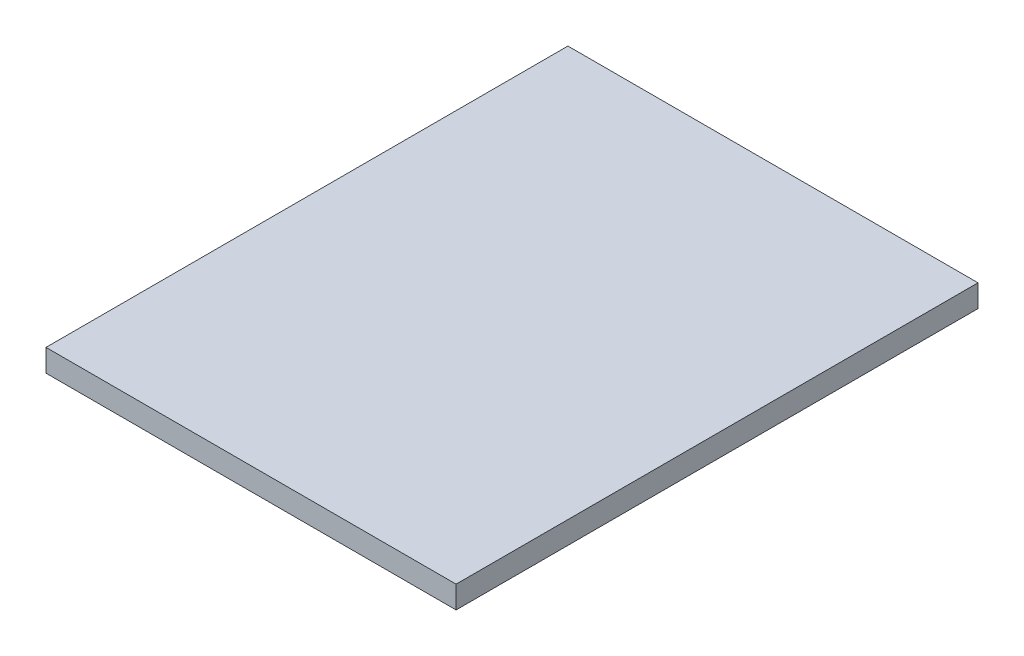
ISO-10303-21;
HEADER;
FILE_DESCRIPTION(('STEP AP214'),'2;1');
FILE_NAME('part.step','',(''),(''),'','','');
FILE_SCHEMA(('AUTOMOTIVE_DESIGN { 1 0 10303 214 1 1 1 1 }'));
ENDSEC;
DATA;
#1=APPLICATION_CONTEXT('core data for automotive mechanical design processes');
#2=APPLICATION_PROTOCOL_DEFINITION('international standard','automotive_design',2000,#1);
#3=PRODUCT_CONTEXT('',#1,'mechanical');
#4=PRODUCT('Part','Part','',(#3));
#5=PRODUCT_RELATED_PRODUCT_CATEGORY('part','',(#4));
#6=PRODUCT_DEFINITION_FORMATION('','',#4);
#7=PRODUCT_DEFINITION_CONTEXT('part definition',#1,'design');
#8=PRODUCT_DEFINITION('design','',#6,#7);
#9=PRODUCT_DEFINITION_SHAPE('','',#8);
#10=(LENGTH_UNIT() NAMED_UNIT(*) SI_UNIT(.MILLI.,.METRE.));
#11=(NAMED_UNIT(*) PLANE_ANGLE_UNIT() SI_UNIT($,.RADIAN.));
#12=(NAMED_UNIT(*) SI_UNIT($,.STERADIAN.) SOLID_ANGLE_UNIT());
#13=UNCERTAINTY_MEASURE_WITH_UNIT(LENGTH_MEASURE(1.E-05),#10,'distance_accuracy_value','');
#14=(GEOMETRIC_REPRESENTATION_CONTEXT(3) GLOBAL_UNCERTAINTY_ASSIGNED_CONTEXT((#13)) GLOBAL_UNIT_ASSIGNED_CONTEXT((#10,
#11,#12)) REPRESENTATION_CONTEXT('',''));
#15=CARTESIAN_POINT('',(0.,0.,0.));
#16=DIRECTION('',(0.,0.,1.));
#17=DIRECTION('',(1.,0.,0.));
#18=AXIS2_PLACEMENT_3D('',#15,#16,#17);
#19=CARTESIAN_POINT('',(11.,1.2,14.));
#20=DIRECTION('',(-1.,0.,0.));
#21=DIRECTION('',(0.,0.,1.));
#22=AXIS2_PLACEMENT_3D('',#19,#20,#21);
#23=PLANE('',#22);
#24=DIRECTION('',(0.,0.,-1.));
#25=VECTOR('',#24,1.);
#26=CARTESIAN_POINT('',(11.,0.,14.));
#27=LINE('',#26,#25);
#28=CARTESIAN_POINT('',(11.,0.,14.));
#29=VERTEX_POINT('',#28);
#30=CARTESIAN_POINT('',(11.,0.,-14.));
#31=VERTEX_POINT('',#30);
#32=EDGE_CURVE('E100',#29,#31,#27,.T.);
#33=ORIENTED_EDGE('',*,*,#32,.T.);
#34=DIRECTION('',(0.,-1.,0.));
#35=VECTOR('',#34,1.);
#36=CARTESIAN_POINT('',(11.,1.2,-14.));
#37=LINE('',#36,#35);
#38=CARTESIAN_POINT('',(11.,1.2,-14.));
#39=VERTEX_POINT('',#38);
#40=EDGE_CURVE('E11',#39,#31,#37,.T.);
#41=ORIENTED_EDGE('',*,*,#40,.F.);
#42=DIRECTION('',(0.,0.,-1.));
#43=VECTOR('',#42,1.);
#44=CARTESIAN_POINT('',(11.,1.2,14.));
#45=LINE('',#44,#43);
#46=CARTESIAN_POINT('',(11.,1.2,14.));
#47=VERTEX_POINT('',#46);
#48=EDGE_CURVE('E88',#47,#39,#45,.T.);
#49=ORIENTED_EDGE('',*,*,#48,.F.);
#50=DIRECTION('',(0.,-1.,0.));
#51=VECTOR('',#50,1.);
#52=CARTESIAN_POINT('',(11.,1.2,14.));
#53=LINE('',#52,#51);
#54=EDGE_CURVE('E96',#47,#29,#53,.T.);
#55=ORIENTED_EDGE('',*,*,#54,.T.);
#56=EDGE_LOOP('',(#33,#41,#49,#55));
#57=FACE_BOUND('',#56,.T.);
#58=ADVANCED_FACE('F37',(#57),#23,.F.);
#59=CARTESIAN_POINT('',(-11.,1.2,-14.));
#60=DIRECTION('',(0.,0.,1.));
#61=DIRECTION('',(1.,0.,0.));
#62=AXIS2_PLACEMENT_3D('',#59,#60,#61);
#63=PLANE('',#62);
#64=DIRECTION('',(-1.,0.,0.));
#65=VECTOR('',#64,1.);
#66=CARTESIAN_POINT('',(-11.,0.,-14.));
#67=LINE('',#66,#65);
#68=CARTESIAN_POINT('',(-11.,0.,-14.));
#69=VERTEX_POINT('',#68);
#70=EDGE_CURVE('E92',#31,#69,#67,.T.);
#71=ORIENTED_EDGE('',*,*,#70,.T.);
#72=DIRECTION('',(0.,-1.,0.));
#73=VECTOR('',#72,1.);
#74=CARTESIAN_POINT('',(-11.,1.2,-14.));
#75=LINE('',#74,#73);
#76=CARTESIAN_POINT('',(-11.,1.2,-14.));
#77=VERTEX_POINT('',#76);
#78=EDGE_CURVE('E45',#77,#69,#75,.T.);
#79=ORIENTED_EDGE('',*,*,#78,.F.);
#80=DIRECTION('',(-1.,0.,0.));
#81=VECTOR('',#80,1.);
#82=CARTESIAN_POINT('',(-11.,1.2,-14.));
#83=LINE('',#82,#81);
#84=EDGE_CURVE('E83',#39,#77,#83,.T.);
#85=ORIENTED_EDGE('',*,*,#84,.F.);
#86=ORIENTED_EDGE('',*,*,#40,.T.);
#87=EDGE_LOOP('',(#71,#79,#85,#86));
#88=FACE_BOUND('',#87,.T.);
#89=ADVANCED_FACE('F91',(#88),#63,.F.);
#90=CARTESIAN_POINT('',(-11.,1.2,14.));
#91=DIRECTION('',(1.,0.,0.));
#92=DIRECTION('',(0.,0.,-1.));
#93=AXIS2_PLACEMENT_3D('',#90,#91,#92);
#94=PLANE('',#93);
#95=DIRECTION('',(0.,0.,1.));
#96=VECTOR('',#95,1.);
#97=CARTESIAN_POINT('',(-11.,0.,14.));
#98=LINE('',#97,#96);
#99=CARTESIAN_POINT('',(-11.,0.,14.));
#100=VERTEX_POINT('',#99);
#101=EDGE_CURVE('E70',#69,#100,#98,.T.);
#102=ORIENTED_EDGE('',*,*,#101,.T.);
#103=DIRECTION('',(0.,-1.,0.));
#104=VECTOR('',#103,1.);
#105=CARTESIAN_POINT('',(-11.,1.2,14.));
#106=LINE('',#105,#104);
#107=CARTESIAN_POINT('',(-11.,1.2,14.));
#108=VERTEX_POINT('',#107);
#109=EDGE_CURVE('E93',#108,#100,#106,.T.);
#110=ORIENTED_EDGE('',*,*,#109,.F.);
#111=DIRECTION('',(0.,0.,1.));
#112=VECTOR('',#111,1.);
#113=CARTESIAN_POINT('',(-11.,1.2,14.));
#114=LINE('',#113,#112);
#115=EDGE_CURVE('E86',#77,#108,#114,.T.);
#116=ORIENTED_EDGE('',*,*,#115,.F.);
#117=ORIENTED_EDGE('',*,*,#78,.T.);
#118=EDGE_LOOP('',(#102,#110,#116,#117));
#119=FACE_BOUND('',#118,.T.);
#120=ADVANCED_FACE('F94',(#119),#94,.F.);
#121=CARTESIAN_POINT('',(-11.,1.2,14.));
#122=DIRECTION('',(0.,0.,-1.));
#123=DIRECTION('',(-1.,0.,0.));
#124=AXIS2_PLACEMENT_3D('',#121,#122,#123);
#125=PLANE('',#124);
#126=DIRECTION('',(1.,0.,0.));
#127=VECTOR('',#126,1.);
#128=CARTESIAN_POINT('',(-11.,0.,14.));
#129=LINE('',#128,#127);
#130=EDGE_CURVE('E76',#100,#29,#129,.T.);
#131=ORIENTED_EDGE('',*,*,#130,.T.);
#132=ORIENTED_EDGE('',*,*,#54,.F.);
#133=DIRECTION('',(1.,0.,0.));
#134=VECTOR('',#133,1.);
#135=CARTESIAN_POINT('',(-11.,1.2,14.));
#136=LINE('',#135,#134);
#137=EDGE_CURVE('E53',#108,#47,#136,.T.);
#138=ORIENTED_EDGE('',*,*,#137,.F.);
#139=ORIENTED_EDGE('',*,*,#109,.T.);
#140=EDGE_LOOP('',(#131,#132,#138,#139));
#141=FACE_BOUND('',#140,.T.);
#142=ADVANCED_FACE('F107',(#141),#125,.F.);
#143=CARTESIAN_POINT('',(0.,1.2,0.));
#144=DIRECTION('',(0.,-1.,0.));
#145=DIRECTION('',(0.,0.,-1.));
#146=AXIS2_PLACEMENT_3D('',#143,#144,#145);
#147=PLANE('',#146);
#148=ORIENTED_EDGE('',*,*,#48,.T.);
#149=ORIENTED_EDGE('',*,*,#84,.T.);
#150=ORIENTED_EDGE('',*,*,#115,.T.);
#151=ORIENTED_EDGE('',*,*,#137,.T.);
#152=EDGE_LOOP('',(#148,#149,#150,#151));
#153=FACE_BOUND('',#152,.T.);
#154=ADVANCED_FACE('F84',(#153),#147,.F.);
#155=CARTESIAN_POINT('',(0.,0.,0.));
#156=DIRECTION('',(0.,-1.,0.));
#157=DIRECTION('',(0.,0.,-1.));
#158=AXIS2_PLACEMENT_3D('',#155,#156,#157);
#159=PLANE('',#158);
#160=ORIENTED_EDGE('',*,*,#32,.F.);
#161=ORIENTED_EDGE('',*,*,#130,.F.);
#162=ORIENTED_EDGE('',*,*,#101,.F.);
#163=ORIENTED_EDGE('',*,*,#70,.F.);
#164=EDGE_LOOP('',(#160,#161,#162,#163));
#165=FACE_BOUND('',#164,.T.);
#166=ADVANCED_FACE('F110',(#165),#159,.T.);
#167=CLOSED_SHELL('',(#58,#89,#120,#142,#154,#166));
#168=MANIFOLD_SOLID_BREP('B2',#167);
#169=ADVANCED_BREP_SHAPE_REPRESENTATION('',(#18,#168),#14);
#170=SHAPE_DEFINITION_REPRESENTATION(#9,#169);
ENDSEC;
END-ISO-10303-21;
